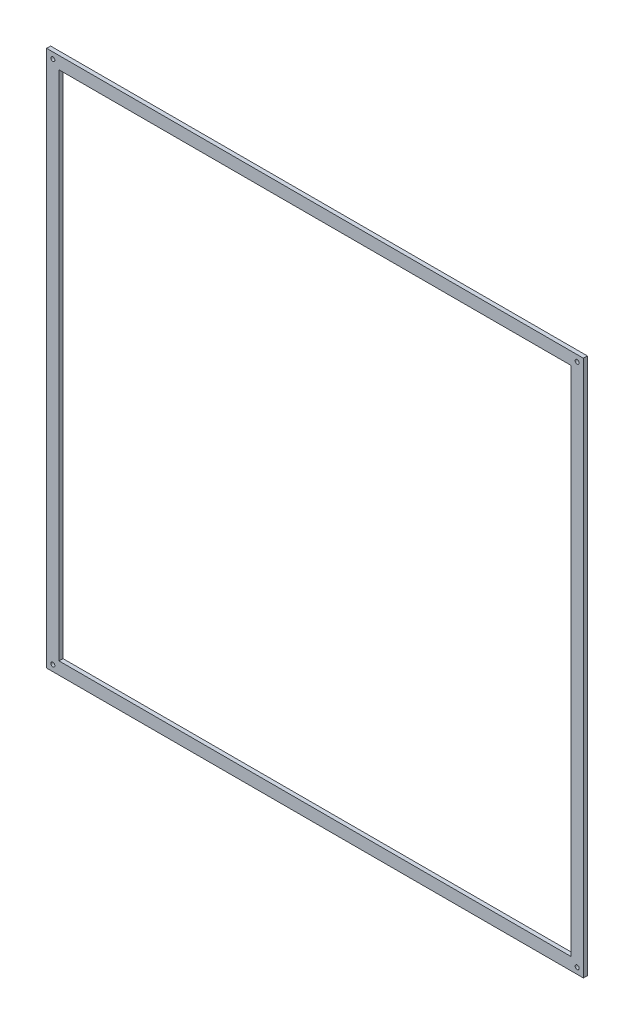
ISO-10303-21;
HEADER;
FILE_DESCRIPTION(('STEP AP214'),'2;1');
FILE_NAME('part.step','',(''),(''),'','','');
FILE_SCHEMA(('AUTOMOTIVE_DESIGN { 1 0 10303 214 1 1 1 1 }'));
ENDSEC;
DATA;
#1=APPLICATION_CONTEXT('core data for automotive mechanical design processes');
#2=APPLICATION_PROTOCOL_DEFINITION('international standard','automotive_design',2000,#1);
#3=PRODUCT_CONTEXT('',#1,'mechanical');
#4=PRODUCT('Part','Part','',(#3));
#5=PRODUCT_RELATED_PRODUCT_CATEGORY('part','',(#4));
#6=PRODUCT_DEFINITION_FORMATION('','',#4);
#7=PRODUCT_DEFINITION_CONTEXT('part definition',#1,'design');
#8=PRODUCT_DEFINITION('design','',#6,#7);
#9=PRODUCT_DEFINITION_SHAPE('','',#8);
#10=(LENGTH_UNIT() NAMED_UNIT(*) SI_UNIT(.MILLI.,.METRE.));
#11=(NAMED_UNIT(*) PLANE_ANGLE_UNIT() SI_UNIT($,.RADIAN.));
#12=(NAMED_UNIT(*) SI_UNIT($,.STERADIAN.) SOLID_ANGLE_UNIT());
#13=UNCERTAINTY_MEASURE_WITH_UNIT(LENGTH_MEASURE(1.E-05),#10,'distance_accuracy_value','');
#14=(GEOMETRIC_REPRESENTATION_CONTEXT(3) GLOBAL_UNCERTAINTY_ASSIGNED_CONTEXT((#13)) GLOBAL_UNIT_ASSIGNED_CONTEXT((#10,
#11,#12)) REPRESENTATION_CONTEXT('',''));
#15=CARTESIAN_POINT('',(0.,0.,0.));
#16=DIRECTION('',(0.,0.,1.));
#17=DIRECTION('',(1.,0.,0.));
#18=AXIS2_PLACEMENT_3D('',#15,#16,#17);
#19=CARTESIAN_POINT('',(0.,0.,10.));
#20=DIRECTION('',(0.,0.,1.));
#21=DIRECTION('',(1.,0.,0.));
#22=AXIS2_PLACEMENT_3D('',#19,#20,#21);
#23=PLANE('',#22);
#24=CARTESIAN_POINT('',(656.195092941153,-656.195092941079,10.));
#25=DIRECTION('',(0.,0.,1.));
#26=DIRECTION('',(1.,0.,0.));
#27=AXIS2_PLACEMENT_3D('',#24,#25,#26);
#28=CIRCLE('',#27,5.00000000005126);
#29=CARTESIAN_POINT('',(661.195092941204,-656.195092941079,10.));
#30=VERTEX_POINT('',#29);
#31=EDGE_CURVE('E140',#30,#30,#28,.T.);
#32=ORIENTED_EDGE('',*,*,#31,.F.);
#33=EDGE_LOOP('',(#32));
#34=FACE_BOUND('',#33,.T.);
#35=CARTESIAN_POINT('',(-656.195092941116,656.195092941116,10.));
#36=DIRECTION('',(0.,0.,1.));
#37=DIRECTION('',(1.,0.,0.));
#38=AXIS2_PLACEMENT_3D('',#35,#36,#37);
#39=CIRCLE('',#38,5.00000000000005);
#40=CARTESIAN_POINT('',(-651.195092941116,656.195092941116,10.));
#41=VERTEX_POINT('',#40);
#42=EDGE_CURVE('E152',#41,#41,#39,.T.);
#43=ORIENTED_EDGE('',*,*,#42,.F.);
#44=EDGE_LOOP('',(#43));
#45=FACE_BOUND('',#44,.T.);
#46=DIRECTION('',(0.,-1.,0.));
#47=VECTOR('',#46,1.);
#48=CARTESIAN_POINT('',(-671.75144212722,671.75144212722,10.));
#49=LINE('',#48,#47);
#50=CARTESIAN_POINT('',(-671.75144212722,671.75144212722,10.));
#51=VERTEX_POINT('',#50);
#52=CARTESIAN_POINT('',(-671.75144212722,-671.75144212722,10.));
#53=VERTEX_POINT('',#52);
#54=EDGE_CURVE('E158',#51,#53,#49,.T.);
#55=ORIENTED_EDGE('',*,*,#54,.T.);
#56=DIRECTION('',(1.,0.,0.));
#57=VECTOR('',#56,1.);
#58=CARTESIAN_POINT('',(-671.75144212722,-671.75144212722,10.));
#59=LINE('',#58,#57);
#60=CARTESIAN_POINT('',(671.75144212722,-671.75144212722,10.));
#61=VERTEX_POINT('',#60);
#62=EDGE_CURVE('E161',#53,#61,#59,.T.);
#63=ORIENTED_EDGE('',*,*,#62,.T.);
#64=DIRECTION('',(0.,1.,0.));
#65=VECTOR('',#64,1.);
#66=CARTESIAN_POINT('',(671.75144212722,-671.75144212722,10.));
#67=LINE('',#66,#65);
#68=CARTESIAN_POINT('',(671.75144212722,671.75144212722,10.));
#69=VERTEX_POINT('',#68);
#70=EDGE_CURVE('E164',#61,#69,#67,.T.);
#71=ORIENTED_EDGE('',*,*,#70,.T.);
#72=DIRECTION('',(-1.,0.,0.));
#73=VECTOR('',#72,1.);
#74=CARTESIAN_POINT('',(671.75144212722,671.75144212722,10.));
#75=LINE('',#74,#73);
#76=EDGE_CURVE('E166',#69,#51,#75,.T.);
#77=ORIENTED_EDGE('',*,*,#76,.T.);
#78=EDGE_LOOP('',(#55,#63,#71,#77));
#79=FACE_BOUND('',#78,.T.);
#80=CARTESIAN_POINT('',(656.195092941116,656.195092941153,10.));
#81=DIRECTION('',(0.,0.,1.));
#82=DIRECTION('',(1.,0.,0.));
#83=AXIS2_PLACEMENT_3D('',#80,#81,#82);
#84=CIRCLE('',#83,5.00000000003798);
#85=CARTESIAN_POINT('',(661.195092941154,656.195092941153,10.));
#86=VERTEX_POINT('',#85);
#87=EDGE_CURVE('E146',#86,#86,#84,.T.);
#88=ORIENTED_EDGE('',*,*,#87,.F.);
#89=EDGE_LOOP('',(#88));
#90=FACE_BOUND('',#89,.T.);
#91=CARTESIAN_POINT('',(-656.195092941079,-656.195092941116,10.));
#92=DIRECTION('',(0.,0.,1.));
#93=DIRECTION('',(1.,0.,0.));
#94=AXIS2_PLACEMENT_3D('',#91,#92,#93);
#95=CIRCLE('',#94,5.00000000001924);
#96=CARTESIAN_POINT('',(-651.19509294106,-656.195092941116,10.));
#97=VERTEX_POINT('',#96);
#98=EDGE_CURVE('E134',#97,#97,#95,.T.);
#99=ORIENTED_EDGE('',*,*,#98,.F.);
#100=EDGE_LOOP('',(#99));
#101=FACE_BOUND('',#100,.T.);
#102=DIRECTION('',(1.,0.,0.));
#103=VECTOR('',#102,1.);
#104=CARTESIAN_POINT('',(-640.638743755012,-640.638743755012,10.));
#105=LINE('',#104,#103);
#106=CARTESIAN_POINT('',(-640.638743755012,-640.638743755012,10.));
#107=VERTEX_POINT('',#106);
#108=CARTESIAN_POINT('',(640.638743755012,-640.638743755012,10.));
#109=VERTEX_POINT('',#108);
#110=EDGE_CURVE('E106',#107,#109,#105,.T.);
#111=ORIENTED_EDGE('',*,*,#110,.F.);
#112=DIRECTION('',(0.,-1.,0.));
#113=VECTOR('',#112,1.);
#114=CARTESIAN_POINT('',(-640.638743755012,640.638743755012,10.));
#115=LINE('',#114,#113);
#116=CARTESIAN_POINT('',(-640.638743755012,640.638743755012,10.));
#117=VERTEX_POINT('',#116);
#118=EDGE_CURVE('E98',#117,#107,#115,.T.);
#119=ORIENTED_EDGE('',*,*,#118,.F.);
#120=DIRECTION('',(-1.,0.,0.));
#121=VECTOR('',#120,1.);
#122=CARTESIAN_POINT('',(640.638743755012,640.638743755013,10.));
#123=LINE('',#122,#121);
#124=CARTESIAN_POINT('',(640.638743755012,640.638743755013,10.));
#125=VERTEX_POINT('',#124);
#126=EDGE_CURVE('E120',#125,#117,#123,.T.);
#127=ORIENTED_EDGE('',*,*,#126,.F.);
#128=DIRECTION('',(0.,1.,0.));
#129=VECTOR('',#128,1.);
#130=CARTESIAN_POINT('',(640.638743755012,-640.638743755012,10.));
#131=LINE('',#130,#129);
#132=EDGE_CURVE('E118',#109,#125,#131,.T.);
#133=ORIENTED_EDGE('',*,*,#132,.F.);
#134=EDGE_LOOP('',(#111,#119,#127,#133));
#135=FACE_BOUND('',#134,.T.);
#136=ADVANCED_FACE('F33',(#34,#45,#79,#90,#101,#135),#23,.T.);
#137=CARTESIAN_POINT('',(0.,0.,0.));
#138=DIRECTION('',(0.,0.,1.));
#139=DIRECTION('',(1.,0.,0.));
#140=AXIS2_PLACEMENT_3D('',#137,#138,#139);
#141=PLANE('',#140);
#142=CARTESIAN_POINT('',(-656.195092941079,-656.195092941116,0.));
#143=DIRECTION('',(0.,0.,1.));
#144=DIRECTION('',(1.,0.,0.));
#145=AXIS2_PLACEMENT_3D('',#142,#143,#144);
#146=CIRCLE('',#145,5.00000000001924);
#147=CARTESIAN_POINT('',(-651.19509294106,-656.195092941116,0.));
#148=VERTEX_POINT('',#147);
#149=EDGE_CURVE('E114',#148,#148,#146,.T.);
#150=ORIENTED_EDGE('',*,*,#149,.T.);
#151=EDGE_LOOP('',(#150));
#152=FACE_BOUND('',#151,.T.);
#153=CARTESIAN_POINT('',(656.195092941153,-656.195092941079,0.));
#154=DIRECTION('',(0.,0.,1.));
#155=DIRECTION('',(1.,0.,0.));
#156=AXIS2_PLACEMENT_3D('',#153,#154,#155);
#157=CIRCLE('',#156,5.00000000005126);
#158=CARTESIAN_POINT('',(661.195092941204,-656.195092941079,0.));
#159=VERTEX_POINT('',#158);
#160=EDGE_CURVE('E137',#159,#159,#157,.T.);
#161=ORIENTED_EDGE('',*,*,#160,.T.);
#162=EDGE_LOOP('',(#161));
#163=FACE_BOUND('',#162,.T.);
#164=CARTESIAN_POINT('',(656.195092941116,656.195092941153,0.));
#165=DIRECTION('',(0.,0.,1.));
#166=DIRECTION('',(1.,0.,0.));
#167=AXIS2_PLACEMENT_3D('',#164,#165,#166);
#168=CIRCLE('',#167,5.00000000003798);
#169=CARTESIAN_POINT('',(661.195092941154,656.195092941153,0.));
#170=VERTEX_POINT('',#169);
#171=EDGE_CURVE('E143',#170,#170,#168,.T.);
#172=ORIENTED_EDGE('',*,*,#171,.T.);
#173=EDGE_LOOP('',(#172));
#174=FACE_BOUND('',#173,.T.);
#175=CARTESIAN_POINT('',(-656.195092941116,656.195092941116,0.));
#176=DIRECTION('',(0.,0.,1.));
#177=DIRECTION('',(1.,0.,0.));
#178=AXIS2_PLACEMENT_3D('',#175,#176,#177);
#179=CIRCLE('',#178,5.00000000000005);
#180=CARTESIAN_POINT('',(-651.195092941116,656.195092941116,0.));
#181=VERTEX_POINT('',#180);
#182=EDGE_CURVE('E149',#181,#181,#179,.T.);
#183=ORIENTED_EDGE('',*,*,#182,.T.);
#184=EDGE_LOOP('',(#183));
#185=FACE_BOUND('',#184,.T.);
#186=DIRECTION('',(0.,-1.,0.));
#187=VECTOR('',#186,1.);
#188=CARTESIAN_POINT('',(-671.75144212722,671.75144212722,0.));
#189=LINE('',#188,#187);
#190=CARTESIAN_POINT('',(-671.75144212722,671.75144212722,0.));
#191=VERTEX_POINT('',#190);
#192=CARTESIAN_POINT('',(-671.75144212722,-671.75144212722,0.));
#193=VERTEX_POINT('',#192);
#194=EDGE_CURVE('E155',#191,#193,#189,.T.);
#195=ORIENTED_EDGE('',*,*,#194,.F.);
#196=DIRECTION('',(-1.,0.,0.));
#197=VECTOR('',#196,1.);
#198=CARTESIAN_POINT('',(671.75144212722,671.75144212722,0.));
#199=LINE('',#198,#197);
#200=CARTESIAN_POINT('',(671.75144212722,671.75144212722,0.));
#201=VERTEX_POINT('',#200);
#202=EDGE_CURVE('E162',#201,#191,#199,.T.);
#203=ORIENTED_EDGE('',*,*,#202,.F.);
#204=DIRECTION('',(0.,1.,0.));
#205=VECTOR('',#204,1.);
#206=CARTESIAN_POINT('',(671.75144212722,-671.75144212722,0.));
#207=LINE('',#206,#205);
#208=CARTESIAN_POINT('',(671.75144212722,-671.75144212722,0.));
#209=VERTEX_POINT('',#208);
#210=EDGE_CURVE('E173',#209,#201,#207,.T.);
#211=ORIENTED_EDGE('',*,*,#210,.F.);
#212=DIRECTION('',(1.,0.,0.));
#213=VECTOR('',#212,1.);
#214=CARTESIAN_POINT('',(-671.75144212722,-671.75144212722,0.));
#215=LINE('',#214,#213);
#216=EDGE_CURVE('E171',#193,#209,#215,.T.);
#217=ORIENTED_EDGE('',*,*,#216,.F.);
#218=EDGE_LOOP('',(#195,#203,#211,#217));
#219=FACE_BOUND('',#218,.T.);
#220=DIRECTION('',(0.,-1.,0.));
#221=VECTOR('',#220,1.);
#222=CARTESIAN_POINT('',(-640.638743755012,640.638743755012,0.));
#223=LINE('',#222,#221);
#224=CARTESIAN_POINT('',(-640.638743755012,640.638743755012,0.));
#225=VERTEX_POINT('',#224);
#226=CARTESIAN_POINT('',(-640.638743755012,-640.638743755012,0.));
#227=VERTEX_POINT('',#226);
#228=EDGE_CURVE('E56',#225,#227,#223,.T.);
#229=ORIENTED_EDGE('',*,*,#228,.T.);
#230=DIRECTION('',(1.,0.,0.));
#231=VECTOR('',#230,1.);
#232=CARTESIAN_POINT('',(-640.638743755012,-640.638743755012,0.));
#233=LINE('',#232,#231);
#234=CARTESIAN_POINT('',(640.638743755012,-640.638743755012,0.));
#235=VERTEX_POINT('',#234);
#236=EDGE_CURVE('E113',#227,#235,#233,.T.);
#237=ORIENTED_EDGE('',*,*,#236,.T.);
#238=DIRECTION('',(0.,1.,0.));
#239=VECTOR('',#238,1.);
#240=CARTESIAN_POINT('',(640.638743755012,-640.638743755012,0.));
#241=LINE('',#240,#239);
#242=CARTESIAN_POINT('',(640.638743755012,640.638743755013,0.));
#243=VERTEX_POINT('',#242);
#244=EDGE_CURVE('E126',#235,#243,#241,.T.);
#245=ORIENTED_EDGE('',*,*,#244,.T.);
#246=DIRECTION('',(-1.,0.,0.));
#247=VECTOR('',#246,1.);
#248=CARTESIAN_POINT('',(640.638743755012,640.638743755013,0.));
#249=LINE('',#248,#247);
#250=EDGE_CURVE('E107',#243,#225,#249,.T.);
#251=ORIENTED_EDGE('',*,*,#250,.T.);
#252=EDGE_LOOP('',(#229,#237,#245,#251));
#253=FACE_BOUND('',#252,.T.);
#254=ADVANCED_FACE('F191',(#152,#163,#174,#185,#219,#253),#141,.F.);
#255=CARTESIAN_POINT('',(-671.75144212722,671.75144212722,10.));
#256=DIRECTION('',(1.,0.,0.));
#257=DIRECTION('',(0.,1.,0.));
#258=AXIS2_PLACEMENT_3D('',#255,#256,#257);
#259=PLANE('',#258);
#260=ORIENTED_EDGE('',*,*,#194,.T.);
#261=DIRECTION('',(0.,0.,-1.));
#262=VECTOR('',#261,1.);
#263=CARTESIAN_POINT('',(-671.75144212722,-671.75144212722,10.));
#264=LINE('',#263,#262);
#265=EDGE_CURVE('E11',#53,#193,#264,.T.);
#266=ORIENTED_EDGE('',*,*,#265,.F.);
#267=ORIENTED_EDGE('',*,*,#54,.F.);
#268=DIRECTION('',(0.,0.,-1.));
#269=VECTOR('',#268,1.);
#270=CARTESIAN_POINT('',(-671.75144212722,671.75144212722,10.));
#271=LINE('',#270,#269);
#272=EDGE_CURVE('E168',#51,#191,#271,.T.);
#273=ORIENTED_EDGE('',*,*,#272,.T.);
#274=EDGE_LOOP('',(#260,#266,#267,#273));
#275=FACE_BOUND('',#274,.T.);
#276=ADVANCED_FACE('F35',(#275),#259,.F.);
#277=CARTESIAN_POINT('',(-671.75144212722,-671.75144212722,10.));
#278=DIRECTION('',(0.,1.,0.));
#279=DIRECTION('',(0.,0.,1.));
#280=AXIS2_PLACEMENT_3D('',#277,#278,#279);
#281=PLANE('',#280);
#282=ORIENTED_EDGE('',*,*,#216,.T.);
#283=DIRECTION('',(0.,0.,-1.));
#284=VECTOR('',#283,1.);
#285=CARTESIAN_POINT('',(671.75144212722,-671.75144212722,10.));
#286=LINE('',#285,#284);
#287=EDGE_CURVE('E41',#61,#209,#286,.T.);
#288=ORIENTED_EDGE('',*,*,#287,.F.);
#289=ORIENTED_EDGE('',*,*,#62,.F.);
#290=ORIENTED_EDGE('',*,*,#265,.T.);
#291=EDGE_LOOP('',(#282,#288,#289,#290));
#292=FACE_BOUND('',#291,.T.);
#293=ADVANCED_FACE('F202',(#292),#281,.F.);
#294=CARTESIAN_POINT('',(671.75144212722,-671.75144212722,10.));
#295=DIRECTION('',(-1.,0.,0.));
#296=DIRECTION('',(0.,-1.,0.));
#297=AXIS2_PLACEMENT_3D('',#294,#295,#296);
#298=PLANE('',#297);
#299=ORIENTED_EDGE('',*,*,#210,.T.);
#300=DIRECTION('',(0.,0.,-1.));
#301=VECTOR('',#300,1.);
#302=CARTESIAN_POINT('',(671.75144212722,671.75144212722,10.));
#303=LINE('',#302,#301);
#304=EDGE_CURVE('E178',#69,#201,#303,.T.);
#305=ORIENTED_EDGE('',*,*,#304,.F.);
#306=ORIENTED_EDGE('',*,*,#70,.F.);
#307=ORIENTED_EDGE('',*,*,#287,.T.);
#308=EDGE_LOOP('',(#299,#305,#306,#307));
#309=FACE_BOUND('',#308,.T.);
#310=ADVANCED_FACE('F185',(#309),#298,.F.);
#311=CARTESIAN_POINT('',(671.75144212722,671.75144212722,10.));
#312=DIRECTION('',(0.,-1.,0.));
#313=DIRECTION('',(1.,0.,0.));
#314=AXIS2_PLACEMENT_3D('',#311,#312,#313);
#315=PLANE('',#314);
#316=ORIENTED_EDGE('',*,*,#202,.T.);
#317=ORIENTED_EDGE('',*,*,#272,.F.);
#318=ORIENTED_EDGE('',*,*,#76,.F.);
#319=ORIENTED_EDGE('',*,*,#304,.T.);
#320=EDGE_LOOP('',(#316,#317,#318,#319));
#321=FACE_BOUND('',#320,.T.);
#322=ADVANCED_FACE('F195',(#321),#315,.F.);
#323=CARTESIAN_POINT('',(-656.195092941116,656.195092941116,10.));
#324=DIRECTION('',(0.,0.,-1.));
#325=DIRECTION('',(-1.,0.,0.));
#326=AXIS2_PLACEMENT_3D('',#323,#324,#325);
#327=CYLINDRICAL_SURFACE('',#326,5.00000000000005);
#328=ORIENTED_EDGE('',*,*,#42,.T.);
#329=EDGE_LOOP('',(#328));
#330=FACE_BOUND('',#329,.T.);
#331=ORIENTED_EDGE('',*,*,#182,.F.);
#332=EDGE_LOOP('',(#331));
#333=FACE_BOUND('',#332,.T.);
#334=ADVANCED_FACE('F220',(#330,#333),#327,.F.);
#335=CARTESIAN_POINT('',(656.195092941116,656.195092941153,10.));
#336=DIRECTION('',(0.,0.,-1.));
#337=DIRECTION('',(-1.,0.,0.));
#338=AXIS2_PLACEMENT_3D('',#335,#336,#337);
#339=CYLINDRICAL_SURFACE('',#338,5.00000000003798);
#340=ORIENTED_EDGE('',*,*,#87,.T.);
#341=EDGE_LOOP('',(#340));
#342=FACE_BOUND('',#341,.T.);
#343=ORIENTED_EDGE('',*,*,#171,.F.);
#344=EDGE_LOOP('',(#343));
#345=FACE_BOUND('',#344,.T.);
#346=ADVANCED_FACE('F227',(#342,#345),#339,.F.);
#347=CARTESIAN_POINT('',(656.195092941153,-656.195092941079,10.));
#348=DIRECTION('',(0.,0.,-1.));
#349=DIRECTION('',(-1.,0.,0.));
#350=AXIS2_PLACEMENT_3D('',#347,#348,#349);
#351=CYLINDRICAL_SURFACE('',#350,5.00000000005126);
#352=ORIENTED_EDGE('',*,*,#31,.T.);
#353=EDGE_LOOP('',(#352));
#354=FACE_BOUND('',#353,.T.);
#355=ORIENTED_EDGE('',*,*,#160,.F.);
#356=EDGE_LOOP('',(#355));
#357=FACE_BOUND('',#356,.T.);
#358=ADVANCED_FACE('F232',(#354,#357),#351,.F.);
#359=CARTESIAN_POINT('',(-656.195092941079,-656.195092941116,10.));
#360=DIRECTION('',(0.,0.,-1.));
#361=DIRECTION('',(-1.,0.,0.));
#362=AXIS2_PLACEMENT_3D('',#359,#360,#361);
#363=CYLINDRICAL_SURFACE('',#362,5.00000000001924);
#364=ORIENTED_EDGE('',*,*,#98,.T.);
#365=EDGE_LOOP('',(#364));
#366=FACE_BOUND('',#365,.T.);
#367=ORIENTED_EDGE('',*,*,#149,.F.);
#368=EDGE_LOOP('',(#367));
#369=FACE_BOUND('',#368,.T.);
#370=ADVANCED_FACE('F241',(#366,#369),#363,.F.);
#371=CARTESIAN_POINT('',(-640.638743755012,640.638743755012,10.));
#372=DIRECTION('',(1.,0.,0.));
#373=DIRECTION('',(0.,1.,0.));
#374=AXIS2_PLACEMENT_3D('',#371,#372,#373);
#375=PLANE('',#374);
#376=ORIENTED_EDGE('',*,*,#228,.F.);
#377=DIRECTION('',(0.,0.,-1.));
#378=VECTOR('',#377,1.);
#379=CARTESIAN_POINT('',(-640.638743755012,640.638743755012,10.));
#380=LINE('',#379,#378);
#381=EDGE_CURVE('E102',#117,#225,#380,.T.);
#382=ORIENTED_EDGE('',*,*,#381,.F.);
#383=ORIENTED_EDGE('',*,*,#118,.T.);
#384=DIRECTION('',(0.,0.,-1.));
#385=VECTOR('',#384,1.);
#386=CARTESIAN_POINT('',(-640.638743755012,-640.638743755012,10.));
#387=LINE('',#386,#385);
#388=EDGE_CURVE('E101',#107,#227,#387,.T.);
#389=ORIENTED_EDGE('',*,*,#388,.T.);
#390=EDGE_LOOP('',(#376,#382,#383,#389));
#391=FACE_BOUND('',#390,.T.);
#392=ADVANCED_FACE('F100',(#391),#375,.T.);
#393=CARTESIAN_POINT('',(-640.638743755012,-640.638743755012,10.));
#394=DIRECTION('',(0.,1.,0.));
#395=DIRECTION('',(-1.,0.,0.));
#396=AXIS2_PLACEMENT_3D('',#393,#394,#395);
#397=PLANE('',#396);
#398=ORIENTED_EDGE('',*,*,#236,.F.);
#399=ORIENTED_EDGE('',*,*,#388,.F.);
#400=ORIENTED_EDGE('',*,*,#110,.T.);
#401=DIRECTION('',(0.,0.,-1.));
#402=VECTOR('',#401,1.);
#403=CARTESIAN_POINT('',(640.638743755012,-640.638743755012,10.));
#404=LINE('',#403,#402);
#405=EDGE_CURVE('E115',#109,#235,#404,.T.);
#406=ORIENTED_EDGE('',*,*,#405,.T.);
#407=EDGE_LOOP('',(#398,#399,#400,#406));
#408=FACE_BOUND('',#407,.T.);
#409=ADVANCED_FACE('F110',(#408),#397,.T.);
#410=CARTESIAN_POINT('',(640.638743755012,-640.638743755012,10.));
#411=DIRECTION('',(-1.,0.,0.));
#412=DIRECTION('',(0.,-1.,0.));
#413=AXIS2_PLACEMENT_3D('',#410,#411,#412);
#414=PLANE('',#413);
#415=ORIENTED_EDGE('',*,*,#244,.F.);
#416=ORIENTED_EDGE('',*,*,#405,.F.);
#417=ORIENTED_EDGE('',*,*,#132,.T.);
#418=DIRECTION('',(0.,0.,-1.));
#419=VECTOR('',#418,1.);
#420=CARTESIAN_POINT('',(640.638743755012,640.638743755013,10.));
#421=LINE('',#420,#419);
#422=EDGE_CURVE('E48',#125,#243,#421,.T.);
#423=ORIENTED_EDGE('',*,*,#422,.T.);
#424=EDGE_LOOP('',(#415,#416,#417,#423));
#425=FACE_BOUND('',#424,.T.);
#426=ADVANCED_FACE('F253',(#425),#414,.T.);
#427=CARTESIAN_POINT('',(640.638743755012,640.638743755013,10.));
#428=DIRECTION('',(0.,-1.,0.));
#429=DIRECTION('',(1.,0.,0.));
#430=AXIS2_PLACEMENT_3D('',#427,#428,#429);
#431=PLANE('',#430);
#432=ORIENTED_EDGE('',*,*,#250,.F.);
#433=ORIENTED_EDGE('',*,*,#422,.F.);
#434=ORIENTED_EDGE('',*,*,#126,.T.);
#435=ORIENTED_EDGE('',*,*,#381,.T.);
#436=EDGE_LOOP('',(#432,#433,#434,#435));
#437=FACE_BOUND('',#436,.T.);
#438=ADVANCED_FACE('F256',(#437),#431,.T.);
#439=CLOSED_SHELL('',(#136,#254,#276,#293,#310,#322,#334,#346,#358,#370,#392,#409,#426,#438));
#440=MANIFOLD_SOLID_BREP('B2',#439);
#441=ADVANCED_BREP_SHAPE_REPRESENTATION('',(#18,#440),#14);
#442=SHAPE_DEFINITION_REPRESENTATION(#9,#441);
ENDSEC;
END-ISO-10303-21;
